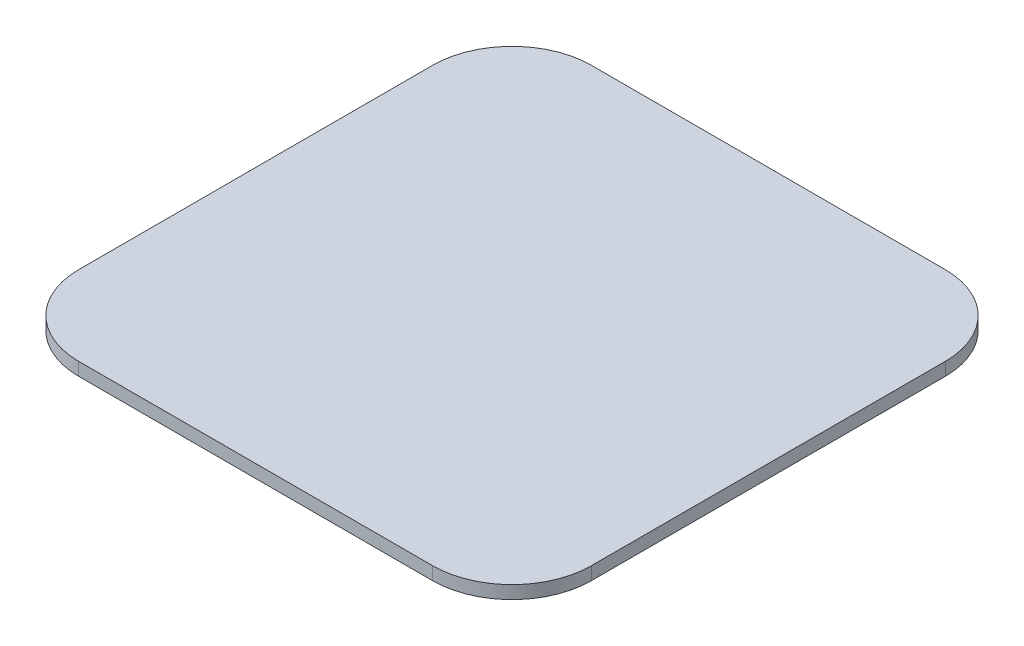
ISO-10303-21;
HEADER;
FILE_DESCRIPTION(('STEP AP214'),'2;1');
FILE_NAME('part.step','',(''),(''),'','','');
FILE_SCHEMA(('AUTOMOTIVE_DESIGN { 1 0 10303 214 1 1 1 1 }'));
ENDSEC;
DATA;
#1=APPLICATION_CONTEXT('core data for automotive mechanical design processes');
#2=APPLICATION_PROTOCOL_DEFINITION('international standard','automotive_design',2000,#1);
#3=PRODUCT_CONTEXT('',#1,'mechanical');
#4=PRODUCT('Part','Part','',(#3));
#5=PRODUCT_RELATED_PRODUCT_CATEGORY('part','',(#4));
#6=PRODUCT_DEFINITION_FORMATION('','',#4);
#7=PRODUCT_DEFINITION_CONTEXT('part definition',#1,'design');
#8=PRODUCT_DEFINITION('design','',#6,#7);
#9=PRODUCT_DEFINITION_SHAPE('','',#8);
#10=(LENGTH_UNIT() NAMED_UNIT(*) SI_UNIT(.MILLI.,.METRE.));
#11=(NAMED_UNIT(*) PLANE_ANGLE_UNIT() SI_UNIT($,.RADIAN.));
#12=(NAMED_UNIT(*) SI_UNIT($,.STERADIAN.) SOLID_ANGLE_UNIT());
#13=UNCERTAINTY_MEASURE_WITH_UNIT(LENGTH_MEASURE(1.E-05),#10,'distance_accuracy_value','');
#14=(GEOMETRIC_REPRESENTATION_CONTEXT(3) GLOBAL_UNCERTAINTY_ASSIGNED_CONTEXT((#13)) GLOBAL_UNIT_ASSIGNED_CONTEXT((#10,
#11,#12)) REPRESENTATION_CONTEXT('',''));
#15=CARTESIAN_POINT('',(0.,0.,0.));
#16=DIRECTION('',(0.,0.,1.));
#17=DIRECTION('',(1.,0.,0.));
#18=AXIS2_PLACEMENT_3D('',#15,#16,#17);
#19=CARTESIAN_POINT('',(-24.5,1.8,24.5));
#20=DIRECTION('',(0.,-1.,0.));
#21=DIRECTION('',(0.,0.,-1.));
#22=AXIS2_PLACEMENT_3D('',#19,#20,#21);
#23=CYLINDRICAL_SURFACE('',#22,11.);
#24=CARTESIAN_POINT('',(-24.5,0.,24.5));
#25=DIRECTION('',(0.,1.,0.));
#26=DIRECTION('',(0.,0.,-1.));
#27=AXIS2_PLACEMENT_3D('',#24,#25,#26);
#28=CIRCLE('',#27,11.);
#29=CARTESIAN_POINT('',(-35.5,0.,24.5));
#30=VERTEX_POINT('',#29);
#31=CARTESIAN_POINT('',(-24.5,0.,35.5));
#32=VERTEX_POINT('',#31);
#33=EDGE_CURVE('E129',#30,#32,#28,.T.);
#34=ORIENTED_EDGE('',*,*,#33,.T.);
#35=DIRECTION('',(0.,-1.,0.));
#36=VECTOR('',#35,1.);
#37=CARTESIAN_POINT('',(-24.5,1.8,35.5));
#38=LINE('',#37,#36);
#39=CARTESIAN_POINT('',(-24.5,1.8,35.5));
#40=VERTEX_POINT('',#39);
#41=EDGE_CURVE('E11',#40,#32,#38,.T.);
#42=ORIENTED_EDGE('',*,*,#41,.F.);
#43=CARTESIAN_POINT('',(-24.5,1.8,24.5));
#44=DIRECTION('',(0.,1.,0.));
#45=DIRECTION('',(0.,0.,-1.));
#46=AXIS2_PLACEMENT_3D('',#43,#44,#45);
#47=CIRCLE('',#46,11.);
#48=CARTESIAN_POINT('',(-35.5,1.8,24.5));
#49=VERTEX_POINT('',#48);
#50=EDGE_CURVE('E143',#49,#40,#47,.T.);
#51=ORIENTED_EDGE('',*,*,#50,.F.);
#52=DIRECTION('',(0.,-1.,0.));
#53=VECTOR('',#52,1.);
#54=CARTESIAN_POINT('',(-35.5,1.8,24.5));
#55=LINE('',#54,#53);
#56=EDGE_CURVE('E125',#49,#30,#55,.T.);
#57=ORIENTED_EDGE('',*,*,#56,.T.);
#58=EDGE_LOOP('',(#34,#42,#51,#57));
#59=FACE_BOUND('',#58,.T.);
#60=ADVANCED_FACE('F33',(#59),#23,.T.);
#61=CARTESIAN_POINT('',(24.5,1.8,35.5));
#62=DIRECTION('',(0.,0.,-1.));
#63=DIRECTION('',(-1.,0.,0.));
#64=AXIS2_PLACEMENT_3D('',#61,#62,#63);
#65=PLANE('',#64);
#66=DIRECTION('',(1.,0.,0.));
#67=VECTOR('',#66,1.);
#68=CARTESIAN_POINT('',(24.5,0.,35.5));
#69=LINE('',#68,#67);
#70=CARTESIAN_POINT('',(24.5,0.,35.5));
#71=VERTEX_POINT('',#70);
#72=EDGE_CURVE('E132',#32,#71,#69,.T.);
#73=ORIENTED_EDGE('',*,*,#72,.T.);
#74=DIRECTION('',(0.,-1.,0.));
#75=VECTOR('',#74,1.);
#76=CARTESIAN_POINT('',(24.5,1.8,35.5));
#77=LINE('',#76,#75);
#78=CARTESIAN_POINT('',(24.5,1.8,35.5));
#79=VERTEX_POINT('',#78);
#80=EDGE_CURVE('E41',#79,#71,#77,.T.);
#81=ORIENTED_EDGE('',*,*,#80,.F.);
#82=DIRECTION('',(1.,0.,0.));
#83=VECTOR('',#82,1.);
#84=CARTESIAN_POINT('',(24.5,1.8,35.5));
#85=LINE('',#84,#83);
#86=EDGE_CURVE('E92',#40,#79,#85,.T.);
#87=ORIENTED_EDGE('',*,*,#86,.F.);
#88=ORIENTED_EDGE('',*,*,#41,.T.);
#89=EDGE_LOOP('',(#73,#81,#87,#88));
#90=FACE_BOUND('',#89,.T.);
#91=ADVANCED_FACE('F178',(#90),#65,.F.);
#92=CARTESIAN_POINT('',(24.5,1.8,24.5));
#93=DIRECTION('',(0.,-1.,0.));
#94=DIRECTION('',(0.,0.,-1.));
#95=AXIS2_PLACEMENT_3D('',#92,#93,#94);
#96=CYLINDRICAL_SURFACE('',#95,11.);
#97=CARTESIAN_POINT('',(24.5,0.,24.5));
#98=DIRECTION('',(0.,1.,0.));
#99=DIRECTION('',(0.,0.,1.));
#100=AXIS2_PLACEMENT_3D('',#97,#98,#99);
#101=CIRCLE('',#100,11.);
#102=CARTESIAN_POINT('',(35.5,0.,24.5));
#103=VERTEX_POINT('',#102);
#104=EDGE_CURVE('E134',#71,#103,#101,.T.);
#105=ORIENTED_EDGE('',*,*,#104,.T.);
#106=DIRECTION('',(0.,-1.,0.));
#107=VECTOR('',#106,1.);
#108=CARTESIAN_POINT('',(35.5,1.8,24.5));
#109=LINE('',#108,#107);
#110=CARTESIAN_POINT('',(35.5,1.8,24.5));
#111=VERTEX_POINT('',#110);
#112=EDGE_CURVE('E150',#111,#103,#109,.T.);
#113=ORIENTED_EDGE('',*,*,#112,.F.);
#114=CARTESIAN_POINT('',(24.5,1.8,24.5));
#115=DIRECTION('',(0.,1.,0.));
#116=DIRECTION('',(0.,0.,1.));
#117=AXIS2_PLACEMENT_3D('',#114,#115,#116);
#118=CIRCLE('',#117,11.);
#119=EDGE_CURVE('E158',#79,#111,#118,.T.);
#120=ORIENTED_EDGE('',*,*,#119,.F.);
#121=ORIENTED_EDGE('',*,*,#80,.T.);
#122=EDGE_LOOP('',(#105,#113,#120,#121));
#123=FACE_BOUND('',#122,.T.);
#124=ADVANCED_FACE('F156',(#123),#96,.T.);
#125=CARTESIAN_POINT('',(35.5,1.8,24.5));
#126=DIRECTION('',(-1.,0.,0.));
#127=DIRECTION('',(0.,0.,1.));
#128=AXIS2_PLACEMENT_3D('',#125,#126,#127);
#129=PLANE('',#128);
#130=DIRECTION('',(0.,0.,-1.));
#131=VECTOR('',#130,1.);
#132=CARTESIAN_POINT('',(35.5,0.,24.5));
#133=LINE('',#132,#131);
#134=CARTESIAN_POINT('',(35.5,0.,-24.5));
#135=VERTEX_POINT('',#134);
#136=EDGE_CURVE('E136',#103,#135,#133,.T.);
#137=ORIENTED_EDGE('',*,*,#136,.T.);
#138=DIRECTION('',(0.,-1.,0.));
#139=VECTOR('',#138,1.);
#140=CARTESIAN_POINT('',(35.5,1.8,-24.5));
#141=LINE('',#140,#139);
#142=CARTESIAN_POINT('',(35.5,1.8,-24.5));
#143=VERTEX_POINT('',#142);
#144=EDGE_CURVE('E147',#143,#135,#141,.T.);
#145=ORIENTED_EDGE('',*,*,#144,.F.);
#146=DIRECTION('',(0.,0.,-1.));
#147=VECTOR('',#146,1.);
#148=CARTESIAN_POINT('',(35.5,1.8,24.5));
#149=LINE('',#148,#147);
#150=EDGE_CURVE('E170',#111,#143,#149,.T.);
#151=ORIENTED_EDGE('',*,*,#150,.F.);
#152=ORIENTED_EDGE('',*,*,#112,.T.);
#153=EDGE_LOOP('',(#137,#145,#151,#152));
#154=FACE_BOUND('',#153,.T.);
#155=ADVANCED_FACE('F166',(#154),#129,.F.);
#156=CARTESIAN_POINT('',(24.5,1.8,-24.5));
#157=DIRECTION('',(0.,-1.,0.));
#158=DIRECTION('',(0.,0.,-1.));
#159=AXIS2_PLACEMENT_3D('',#156,#157,#158);
#160=CYLINDRICAL_SURFACE('',#159,11.);
#161=CARTESIAN_POINT('',(24.5,0.,-24.5));
#162=DIRECTION('',(0.,1.,0.));
#163=DIRECTION('',(0.,0.,1.));
#164=AXIS2_PLACEMENT_3D('',#161,#162,#163);
#165=CIRCLE('',#164,11.);
#166=CARTESIAN_POINT('',(24.5,0.,-35.5));
#167=VERTEX_POINT('',#166);
#168=EDGE_CURVE('E138',#135,#167,#165,.T.);
#169=ORIENTED_EDGE('',*,*,#168,.T.);
#170=DIRECTION('',(0.,-1.,0.));
#171=VECTOR('',#170,1.);
#172=CARTESIAN_POINT('',(24.5,1.8,-35.5));
#173=LINE('',#172,#171);
#174=CARTESIAN_POINT('',(24.5,1.8,-35.5));
#175=VERTEX_POINT('',#174);
#176=EDGE_CURVE('E120',#175,#167,#173,.T.);
#177=ORIENTED_EDGE('',*,*,#176,.F.);
#178=CARTESIAN_POINT('',(24.5,1.8,-24.5));
#179=DIRECTION('',(0.,1.,0.));
#180=DIRECTION('',(0.,0.,1.));
#181=AXIS2_PLACEMENT_3D('',#178,#179,#180);
#182=CIRCLE('',#181,11.);
#183=EDGE_CURVE('E111',#143,#175,#182,.T.);
#184=ORIENTED_EDGE('',*,*,#183,.F.);
#185=ORIENTED_EDGE('',*,*,#144,.T.);
#186=EDGE_LOOP('',(#169,#177,#184,#185));
#187=FACE_BOUND('',#186,.T.);
#188=ADVANCED_FACE('F169',(#187),#160,.T.);
#189=CARTESIAN_POINT('',(24.5,1.8,-35.5));
#190=DIRECTION('',(0.,0.,1.));
#191=DIRECTION('',(1.,0.,0.));
#192=AXIS2_PLACEMENT_3D('',#189,#190,#191);
#193=PLANE('',#192);
#194=DIRECTION('',(-1.,0.,0.));
#195=VECTOR('',#194,1.);
#196=CARTESIAN_POINT('',(24.5,0.,-35.5));
#197=LINE('',#196,#195);
#198=CARTESIAN_POINT('',(-24.5,0.,-35.5));
#199=VERTEX_POINT('',#198);
#200=EDGE_CURVE('E119',#167,#199,#197,.T.);
#201=ORIENTED_EDGE('',*,*,#200,.T.);
#202=DIRECTION('',(0.,-1.,0.));
#203=VECTOR('',#202,1.);
#204=CARTESIAN_POINT('',(-24.5,1.8,-35.5));
#205=LINE('',#204,#203);
#206=CARTESIAN_POINT('',(-24.5,1.8,-35.5));
#207=VERTEX_POINT('',#206);
#208=EDGE_CURVE('E116',#207,#199,#205,.T.);
#209=ORIENTED_EDGE('',*,*,#208,.F.);
#210=DIRECTION('',(-1.,0.,0.));
#211=VECTOR('',#210,1.);
#212=CARTESIAN_POINT('',(24.5,1.8,-35.5));
#213=LINE('',#212,#211);
#214=EDGE_CURVE('E105',#175,#207,#213,.T.);
#215=ORIENTED_EDGE('',*,*,#214,.F.);
#216=ORIENTED_EDGE('',*,*,#176,.T.);
#217=EDGE_LOOP('',(#201,#209,#215,#216));
#218=FACE_BOUND('',#217,.T.);
#219=ADVANCED_FACE('F117',(#218),#193,.F.);
#220=CARTESIAN_POINT('',(-24.5,1.8,-24.5));
#221=DIRECTION('',(0.,-1.,0.));
#222=DIRECTION('',(0.,0.,-1.));
#223=AXIS2_PLACEMENT_3D('',#220,#221,#222);
#224=CYLINDRICAL_SURFACE('',#223,11.);
#225=CARTESIAN_POINT('',(-24.5,0.,-24.5));
#226=DIRECTION('',(0.,1.,0.));
#227=DIRECTION('',(0.,0.,1.));
#228=AXIS2_PLACEMENT_3D('',#225,#226,#227);
#229=CIRCLE('',#228,11.);
#230=CARTESIAN_POINT('',(-35.5,0.,-24.5));
#231=VERTEX_POINT('',#230);
#232=EDGE_CURVE('E78',#199,#231,#229,.T.);
#233=ORIENTED_EDGE('',*,*,#232,.T.);
#234=DIRECTION('',(0.,-1.,0.));
#235=VECTOR('',#234,1.);
#236=CARTESIAN_POINT('',(-35.5,1.8,-24.5));
#237=LINE('',#236,#235);
#238=CARTESIAN_POINT('',(-35.5,1.8,-24.5));
#239=VERTEX_POINT('',#238);
#240=EDGE_CURVE('E121',#239,#231,#237,.T.);
#241=ORIENTED_EDGE('',*,*,#240,.F.);
#242=CARTESIAN_POINT('',(-24.5,1.8,-24.5));
#243=DIRECTION('',(0.,1.,0.));
#244=DIRECTION('',(0.,0.,1.));
#245=AXIS2_PLACEMENT_3D('',#242,#243,#244);
#246=CIRCLE('',#245,11.);
#247=EDGE_CURVE('E109',#207,#239,#246,.T.);
#248=ORIENTED_EDGE('',*,*,#247,.F.);
#249=ORIENTED_EDGE('',*,*,#208,.T.);
#250=EDGE_LOOP('',(#233,#241,#248,#249));
#251=FACE_BOUND('',#250,.T.);
#252=ADVANCED_FACE('F123',(#251),#224,.T.);
#253=CARTESIAN_POINT('',(-35.5,1.8,24.5));
#254=DIRECTION('',(1.,0.,0.));
#255=DIRECTION('',(0.,0.,-1.));
#256=AXIS2_PLACEMENT_3D('',#253,#254,#255);
#257=PLANE('',#256);
#258=DIRECTION('',(0.,0.,1.));
#259=VECTOR('',#258,1.);
#260=CARTESIAN_POINT('',(-35.5,0.,24.5));
#261=LINE('',#260,#259);
#262=EDGE_CURVE('E84',#231,#30,#261,.T.);
#263=ORIENTED_EDGE('',*,*,#262,.T.);
#264=ORIENTED_EDGE('',*,*,#56,.F.);
#265=DIRECTION('',(0.,0.,1.));
#266=VECTOR('',#265,1.);
#267=CARTESIAN_POINT('',(-35.5,1.8,24.5));
#268=LINE('',#267,#266);
#269=EDGE_CURVE('E49',#239,#49,#268,.T.);
#270=ORIENTED_EDGE('',*,*,#269,.F.);
#271=ORIENTED_EDGE('',*,*,#240,.T.);
#272=EDGE_LOOP('',(#263,#264,#270,#271));
#273=FACE_BOUND('',#272,.T.);
#274=ADVANCED_FACE('F194',(#273),#257,.F.);
#275=CARTESIAN_POINT('',(-24.5,1.8,24.5));
#276=DIRECTION('',(0.,-1.,0.));
#277=DIRECTION('',(0.,0.,-1.));
#278=AXIS2_PLACEMENT_3D('',#275,#276,#277);
#279=PLANE('',#278);
#280=ORIENTED_EDGE('',*,*,#50,.T.);
#281=ORIENTED_EDGE('',*,*,#86,.T.);
#282=ORIENTED_EDGE('',*,*,#119,.T.);
#283=ORIENTED_EDGE('',*,*,#150,.T.);
#284=ORIENTED_EDGE('',*,*,#183,.T.);
#285=ORIENTED_EDGE('',*,*,#214,.T.);
#286=ORIENTED_EDGE('',*,*,#247,.T.);
#287=ORIENTED_EDGE('',*,*,#269,.T.);
#288=EDGE_LOOP('',(#280,#281,#282,#283,#284,#285,#286,#287));
#289=FACE_BOUND('',#288,.T.);
#290=ADVANCED_FACE('F107',(#289),#279,.F.);
#291=CARTESIAN_POINT('',(-24.5,0.,24.5));
#292=DIRECTION('',(0.,-1.,0.));
#293=DIRECTION('',(0.,0.,-1.));
#294=AXIS2_PLACEMENT_3D('',#291,#292,#293);
#295=PLANE('',#294);
#296=ORIENTED_EDGE('',*,*,#33,.F.);
#297=ORIENTED_EDGE('',*,*,#262,.F.);
#298=ORIENTED_EDGE('',*,*,#232,.F.);
#299=ORIENTED_EDGE('',*,*,#200,.F.);
#300=ORIENTED_EDGE('',*,*,#168,.F.);
#301=ORIENTED_EDGE('',*,*,#136,.F.);
#302=ORIENTED_EDGE('',*,*,#104,.F.);
#303=ORIENTED_EDGE('',*,*,#72,.F.);
#304=EDGE_LOOP('',(#296,#297,#298,#299,#300,#301,#302,#303));
#305=FACE_BOUND('',#304,.T.);
#306=ADVANCED_FACE('F162',(#305),#295,.T.);
#307=CLOSED_SHELL('',(#60,#91,#124,#155,#188,#219,#252,#274,#290,#306));
#308=MANIFOLD_SOLID_BREP('B2',#307);
#309=ADVANCED_BREP_SHAPE_REPRESENTATION('',(#18,#308),#14);
#310=SHAPE_DEFINITION_REPRESENTATION(#9,#309);
ENDSEC;
END-ISO-10303-21;
